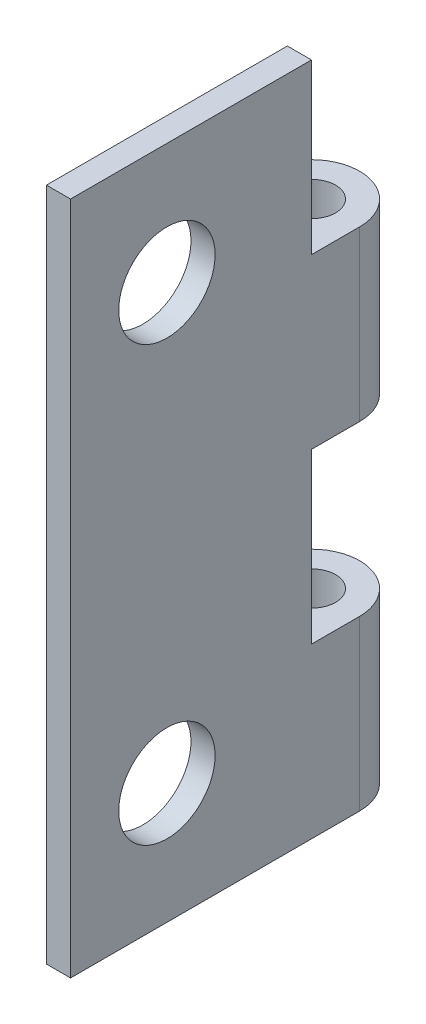
ISO-10303-21;
HEADER;
FILE_DESCRIPTION(('STEP AP214'),'2;1');
FILE_NAME('part.step','',(''),(''),'','','');
FILE_SCHEMA(('AUTOMOTIVE_DESIGN { 1 0 10303 214 1 1 1 1 }'));
ENDSEC;
DATA;
#1=APPLICATION_CONTEXT('core data for automotive mechanical design processes');
#2=APPLICATION_PROTOCOL_DEFINITION('international standard','automotive_design',2000,#1);
#3=PRODUCT_CONTEXT('',#1,'mechanical');
#4=PRODUCT('Part','Part','',(#3));
#5=PRODUCT_RELATED_PRODUCT_CATEGORY('part','',(#4));
#6=PRODUCT_DEFINITION_FORMATION('','',#4);
#7=PRODUCT_DEFINITION_CONTEXT('part definition',#1,'design');
#8=PRODUCT_DEFINITION('design','',#6,#7);
#9=PRODUCT_DEFINITION_SHAPE('','',#8);
#10=(LENGTH_UNIT() NAMED_UNIT(*) SI_UNIT(.MILLI.,.METRE.));
#11=(NAMED_UNIT(*) PLANE_ANGLE_UNIT() SI_UNIT($,.RADIAN.));
#12=(NAMED_UNIT(*) SI_UNIT($,.STERADIAN.) SOLID_ANGLE_UNIT());
#13=UNCERTAINTY_MEASURE_WITH_UNIT(LENGTH_MEASURE(1.E-05),#10,'distance_accuracy_value','');
#14=(GEOMETRIC_REPRESENTATION_CONTEXT(3) GLOBAL_UNCERTAINTY_ASSIGNED_CONTEXT((#13)) GLOBAL_UNIT_ASSIGNED_CONTEXT((#10,
#11,#12)) REPRESENTATION_CONTEXT('',''));
#15=CARTESIAN_POINT('',(0.,0.,0.));
#16=DIRECTION('',(0.,0.,1.));
#17=DIRECTION('',(1.,0.,0.));
#18=AXIS2_PLACEMENT_3D('',#15,#16,#17);
#19=CARTESIAN_POINT('',(-1.73331649571264,28.,-3.));
#20=DIRECTION('',(0.,-1.,0.));
#21=DIRECTION('',(0.,0.,-1.));
#22=AXIS2_PLACEMENT_3D('',#19,#20,#21);
#23=CYLINDRICAL_SURFACE('',#22,2.);
#24=DIRECTION('',(0.,-1.,0.));
#25=VECTOR('',#24,1.);
#26=CARTESIAN_POINT('',(-0.733316495712644,28.,-1.26794919243112));
#27=LINE('',#26,#25);
#28=CARTESIAN_POINT('',(-0.733316495712644,7.,-1.26794919243112));
#29=VERTEX_POINT('',#28);
#30=CARTESIAN_POINT('',(-0.733316495712644,0.,-1.26794919243112));
#31=VERTEX_POINT('',#30);
#32=EDGE_CURVE('E201',#29,#31,#27,.T.);
#33=ORIENTED_EDGE('',*,*,#32,.F.);
#34=CARTESIAN_POINT('',(-1.73331649571264,7.,-3.));
#35=DIRECTION('',(0.,-1.,0.));
#36=DIRECTION('',(0.,0.,-1.));
#37=AXIS2_PLACEMENT_3D('',#34,#35,#36);
#38=CIRCLE('',#37,2.);
#39=CARTESIAN_POINT('',(0.266683504287357,7.,-3.));
#40=VERTEX_POINT('',#39);
#41=EDGE_CURVE('E160',#29,#40,#38,.T.);
#42=ORIENTED_EDGE('',*,*,#41,.T.);
#43=DIRECTION('',(0.,-1.,0.));
#44=VECTOR('',#43,1.);
#45=CARTESIAN_POINT('',(0.266683504287357,28.,-3.));
#46=LINE('',#45,#44);
#47=CARTESIAN_POINT('',(0.266683504287357,0.,-3.));
#48=VERTEX_POINT('',#47);
#49=EDGE_CURVE('E182',#40,#48,#46,.T.);
#50=ORIENTED_EDGE('',*,*,#49,.T.);
#51=CARTESIAN_POINT('',(-1.73331649571264,0.,-3.));
#52=DIRECTION('',(0.,1.,0.));
#53=DIRECTION('',(0.,0.,1.));
#54=AXIS2_PLACEMENT_3D('',#51,#52,#53);
#55=CIRCLE('',#54,2.);
#56=EDGE_CURVE('E174',#48,#31,#55,.T.);
#57=ORIENTED_EDGE('',*,*,#56,.T.);
#58=EDGE_LOOP('',(#33,#42,#50,#57));
#59=FACE_BOUND('',#58,.T.);
#60=ADVANCED_FACE('F41',(#59),#23,.T.);
#61=CARTESIAN_POINT('',(-0.733316495712644,21.,-1.26794919243112));
#62=VERTEX_POINT('',#61);
#63=CARTESIAN_POINT('',(-0.733316495712644,14.,-1.26794919243112));
#64=VERTEX_POINT('',#63);
#65=EDGE_CURVE('E50',#62,#64,#27,.T.);
#66=ORIENTED_EDGE('',*,*,#65,.F.);
#67=CARTESIAN_POINT('',(-1.73331649571264,21.,-3.));
#68=DIRECTION('',(0.,-1.,0.));
#69=DIRECTION('',(0.,0.,-1.));
#70=AXIS2_PLACEMENT_3D('',#67,#68,#69);
#71=CIRCLE('',#70,2.);
#72=CARTESIAN_POINT('',(0.266683504287357,21.,-3.));
#73=VERTEX_POINT('',#72);
#74=EDGE_CURVE('E169',#62,#73,#71,.T.);
#75=ORIENTED_EDGE('',*,*,#74,.T.);
#76=CARTESIAN_POINT('',(0.266683504287357,14.,-3.));
#77=VERTEX_POINT('',#76);
#78=EDGE_CURVE('E139',#73,#77,#46,.T.);
#79=ORIENTED_EDGE('',*,*,#78,.T.);
#80=CARTESIAN_POINT('',(-1.73331649571264,14.,-3.));
#81=DIRECTION('',(0.,1.,0.));
#82=DIRECTION('',(0.,0.,1.));
#83=AXIS2_PLACEMENT_3D('',#80,#81,#82);
#84=CIRCLE('',#83,2.);
#85=EDGE_CURVE('E166',#77,#64,#84,.T.);
#86=ORIENTED_EDGE('',*,*,#85,.T.);
#87=EDGE_LOOP('',(#66,#75,#79,#86));
#88=FACE_BOUND('',#87,.T.);
#89=ADVANCED_FACE('F43',(#88),#23,.T.);
#90=CARTESIAN_POINT('',(-0.733316495712644,28.,0.));
#91=DIRECTION('',(1.,0.,0.));
#92=DIRECTION('',(0.,0.,-1.));
#93=AXIS2_PLACEMENT_3D('',#90,#91,#92);
#94=PLANE('',#93);
#95=CARTESIAN_POINT('',(-0.733316495712643,23.,5.));
#96=DIRECTION('',(1.,0.,0.));
#97=DIRECTION('',(0.,0.,-1.));
#98=AXIS2_PLACEMENT_3D('',#95,#96,#97);
#99=CIRCLE('',#98,2.);
#100=CARTESIAN_POINT('',(-0.733316495712643,23.,3.));
#101=VERTEX_POINT('',#100);
#102=EDGE_CURVE('E148',#101,#101,#99,.T.);
#103=ORIENTED_EDGE('',*,*,#102,.T.);
#104=EDGE_LOOP('',(#103));
#105=FACE_BOUND('',#104,.T.);
#106=CARTESIAN_POINT('',(-0.733316495712643,5.,5.));
#107=DIRECTION('',(1.,0.,0.));
#108=DIRECTION('',(0.,0.,-1.));
#109=AXIS2_PLACEMENT_3D('',#106,#107,#108);
#110=CIRCLE('',#109,2.);
#111=CARTESIAN_POINT('',(-0.733316495712643,5.,3.));
#112=VERTEX_POINT('',#111);
#113=EDGE_CURVE('E294',#112,#112,#110,.T.);
#114=ORIENTED_EDGE('',*,*,#113,.T.);
#115=EDGE_LOOP('',(#114));
#116=FACE_BOUND('',#115,.T.);
#117=DIRECTION('',(0.,0.,1.));
#118=VECTOR('',#117,1.);
#119=CARTESIAN_POINT('',(-0.733316495712644,28.,0.));
#120=LINE('',#119,#118);
#121=CARTESIAN_POINT('',(-0.733316495712644,28.,-1.));
#122=VERTEX_POINT('',#121);
#123=CARTESIAN_POINT('',(-0.733316495712643,28.,9.));
#124=VERTEX_POINT('',#123);
#125=EDGE_CURVE('E175',#122,#124,#120,.T.);
#126=ORIENTED_EDGE('',*,*,#125,.F.);
#127=DIRECTION('',(0.,-1.,0.));
#128=VECTOR('',#127,1.);
#129=CARTESIAN_POINT('',(-0.733316495712644,28.,-1.));
#130=LINE('',#129,#128);
#131=CARTESIAN_POINT('',(-0.733316495712644,21.,-1.));
#132=VERTEX_POINT('',#131);
#133=EDGE_CURVE('E65',#122,#132,#130,.T.);
#134=ORIENTED_EDGE('',*,*,#133,.T.);
#135=DIRECTION('',(0.,0.,-1.));
#136=VECTOR('',#135,1.);
#137=CARTESIAN_POINT('',(-0.733316495712644,21.,0.));
#138=LINE('',#137,#136);
#139=EDGE_CURVE('E127',#132,#62,#138,.T.);
#140=ORIENTED_EDGE('',*,*,#139,.T.);
#141=ORIENTED_EDGE('',*,*,#65,.T.);
#142=DIRECTION('',(0.,0.,1.));
#143=VECTOR('',#142,1.);
#144=CARTESIAN_POINT('',(-0.733316495712644,14.,0.));
#145=LINE('',#144,#143);
#146=CARTESIAN_POINT('',(-0.733316495712644,14.,-1.));
#147=VERTEX_POINT('',#146);
#148=EDGE_CURVE('E163',#64,#147,#145,.T.);
#149=ORIENTED_EDGE('',*,*,#148,.T.);
#150=DIRECTION('',(0.,-1.,0.));
#151=VECTOR('',#150,1.);
#152=CARTESIAN_POINT('',(-0.733316495712644,28.,-0.999999999999999));
#153=LINE('',#152,#151);
#154=CARTESIAN_POINT('',(-0.733316495712644,7.,-1.));
#155=VERTEX_POINT('',#154);
#156=EDGE_CURVE('E171',#147,#155,#153,.T.);
#157=ORIENTED_EDGE('',*,*,#156,.T.);
#158=DIRECTION('',(0.,0.,-1.));
#159=VECTOR('',#158,1.);
#160=CARTESIAN_POINT('',(-0.733316495712644,7.,0.));
#161=LINE('',#160,#159);
#162=EDGE_CURVE('E157',#155,#29,#161,.T.);
#163=ORIENTED_EDGE('',*,*,#162,.T.);
#164=ORIENTED_EDGE('',*,*,#32,.T.);
#165=DIRECTION('',(0.,0.,1.));
#166=VECTOR('',#165,1.);
#167=CARTESIAN_POINT('',(-0.733316495712644,0.,0.));
#168=LINE('',#167,#166);
#169=CARTESIAN_POINT('',(-0.733316495712643,0.,9.));
#170=VERTEX_POINT('',#169);
#171=EDGE_CURVE('E185',#31,#170,#168,.T.);
#172=ORIENTED_EDGE('',*,*,#171,.T.);
#173=DIRECTION('',(0.,-1.,0.));
#174=VECTOR('',#173,1.);
#175=CARTESIAN_POINT('',(-0.733316495712643,28.,9.));
#176=LINE('',#175,#174);
#177=EDGE_CURVE('E198',#124,#170,#176,.T.);
#178=ORIENTED_EDGE('',*,*,#177,.F.);
#179=EDGE_LOOP('',(#126,#134,#140,#141,#149,#157,#163,#164,#172,#178));
#180=FACE_BOUND('',#179,.T.);
#181=ADVANCED_FACE('F237',(#105,#116,#180),#94,.F.);
#182=CARTESIAN_POINT('',(0.,28.,9.));
#183=DIRECTION('',(0.,0.,-1.));
#184=DIRECTION('',(-1.,0.,0.));
#185=AXIS2_PLACEMENT_3D('',#182,#183,#184);
#186=PLANE('',#185);
#187=DIRECTION('',(1.,0.,0.));
#188=VECTOR('',#187,1.);
#189=CARTESIAN_POINT('',(0.,0.,9.));
#190=LINE('',#189,#188);
#191=CARTESIAN_POINT('',(0.266683504287357,0.,9.));
#192=VERTEX_POINT('',#191);
#193=EDGE_CURVE('E187',#170,#192,#190,.T.);
#194=ORIENTED_EDGE('',*,*,#193,.T.);
#195=DIRECTION('',(0.,-1.,0.));
#196=VECTOR('',#195,1.);
#197=CARTESIAN_POINT('',(0.266683504287357,28.,9.));
#198=LINE('',#197,#196);
#199=CARTESIAN_POINT('',(0.266683504287357,28.,9.));
#200=VERTEX_POINT('',#199);
#201=EDGE_CURVE('E195',#200,#192,#198,.T.);
#202=ORIENTED_EDGE('',*,*,#201,.F.);
#203=DIRECTION('',(1.,0.,0.));
#204=VECTOR('',#203,1.);
#205=CARTESIAN_POINT('',(0.,28.,9.));
#206=LINE('',#205,#204);
#207=EDGE_CURVE('E177',#124,#200,#206,.T.);
#208=ORIENTED_EDGE('',*,*,#207,.F.);
#209=ORIENTED_EDGE('',*,*,#177,.T.);
#210=EDGE_LOOP('',(#194,#202,#208,#209));
#211=FACE_BOUND('',#210,.T.);
#212=ADVANCED_FACE('F252',(#211),#186,.F.);
#213=CARTESIAN_POINT('',(0.266683504287357,28.,0.));
#214=DIRECTION('',(-1.,0.,0.));
#215=DIRECTION('',(0.,0.,1.));
#216=AXIS2_PLACEMENT_3D('',#213,#214,#215);
#217=PLANE('',#216);
#218=CARTESIAN_POINT('',(0.266683504287357,23.,5.));
#219=DIRECTION('',(1.,0.,0.));
#220=DIRECTION('',(0.,0.,-1.));
#221=AXIS2_PLACEMENT_3D('',#218,#219,#220);
#222=CIRCLE('',#221,2.);
#223=CARTESIAN_POINT('',(0.266683504287357,23.,3.));
#224=VERTEX_POINT('',#223);
#225=EDGE_CURVE('E290',#224,#224,#222,.T.);
#226=ORIENTED_EDGE('',*,*,#225,.F.);
#227=EDGE_LOOP('',(#226));
#228=FACE_BOUND('',#227,.T.);
#229=CARTESIAN_POINT('',(0.266683504287357,5.,5.));
#230=DIRECTION('',(1.,0.,0.));
#231=DIRECTION('',(0.,0.,-1.));
#232=AXIS2_PLACEMENT_3D('',#229,#230,#231);
#233=CIRCLE('',#232,2.);
#234=CARTESIAN_POINT('',(0.266683504287357,5.,3.));
#235=VERTEX_POINT('',#234);
#236=EDGE_CURVE('E298',#235,#235,#233,.T.);
#237=ORIENTED_EDGE('',*,*,#236,.F.);
#238=EDGE_LOOP('',(#237));
#239=FACE_BOUND('',#238,.T.);
#240=DIRECTION('',(0.,0.,-1.));
#241=VECTOR('',#240,1.);
#242=CARTESIAN_POINT('',(0.266683504287357,21.,-1.));
#243=LINE('',#242,#241);
#244=CARTESIAN_POINT('',(0.266683504287357,21.,-1.));
#245=VERTEX_POINT('',#244);
#246=EDGE_CURVE('E124',#245,#73,#243,.T.);
#247=ORIENTED_EDGE('',*,*,#246,.F.);
#248=DIRECTION('',(0.,-1.,0.));
#249=VECTOR('',#248,1.);
#250=CARTESIAN_POINT('',(0.266683504287357,28.,-1.));
#251=LINE('',#250,#249);
#252=CARTESIAN_POINT('',(0.266683504287357,28.,-1.));
#253=VERTEX_POINT('',#252);
#254=EDGE_CURVE('E130',#253,#245,#251,.T.);
#255=ORIENTED_EDGE('',*,*,#254,.F.);
#256=DIRECTION('',(0.,0.,-1.));
#257=VECTOR('',#256,1.);
#258=CARTESIAN_POINT('',(0.266683504287357,28.,0.));
#259=LINE('',#258,#257);
#260=EDGE_CURVE('E180',#200,#253,#259,.T.);
#261=ORIENTED_EDGE('',*,*,#260,.F.);
#262=ORIENTED_EDGE('',*,*,#201,.T.);
#263=DIRECTION('',(0.,0.,-1.));
#264=VECTOR('',#263,1.);
#265=CARTESIAN_POINT('',(0.266683504287357,0.,0.));
#266=LINE('',#265,#264);
#267=EDGE_CURVE('E189',#192,#48,#266,.T.);
#268=ORIENTED_EDGE('',*,*,#267,.T.);
#269=ORIENTED_EDGE('',*,*,#49,.F.);
#270=DIRECTION('',(0.,0.,-1.));
#271=VECTOR('',#270,1.);
#272=CARTESIAN_POINT('',(0.266683504287357,7.,-1.));
#273=LINE('',#272,#271);
#274=CARTESIAN_POINT('',(0.266683504287357,7.,-1.));
#275=VERTEX_POINT('',#274);
#276=EDGE_CURVE('E151',#275,#40,#273,.T.);
#277=ORIENTED_EDGE('',*,*,#276,.F.);
#278=DIRECTION('',(0.,-1.,0.));
#279=VECTOR('',#278,1.);
#280=CARTESIAN_POINT('',(0.266683504287357,14.,-1.));
#281=LINE('',#280,#279);
#282=CARTESIAN_POINT('',(0.266683504287357,14.,-1.));
#283=VERTEX_POINT('',#282);
#284=EDGE_CURVE('E58',#283,#275,#281,.T.);
#285=ORIENTED_EDGE('',*,*,#284,.F.);
#286=DIRECTION('',(0.,0.,1.));
#287=VECTOR('',#286,1.);
#288=CARTESIAN_POINT('',(0.266683504287357,14.,-1.));
#289=LINE('',#288,#287);
#290=EDGE_CURVE('E145',#77,#283,#289,.T.);
#291=ORIENTED_EDGE('',*,*,#290,.F.);
#292=ORIENTED_EDGE('',*,*,#78,.F.);
#293=EDGE_LOOP('',(#247,#255,#261,#262,#268,#269,#277,#285,#291,#292));
#294=FACE_BOUND('',#293,.T.);
#295=ADVANCED_FACE('F136',(#228,#239,#294),#217,.F.);
#296=CARTESIAN_POINT('',(-1.73331649571264,28.,-3.));
#297=DIRECTION('',(0.,-1.,0.));
#298=DIRECTION('',(0.,0.,-1.));
#299=AXIS2_PLACEMENT_3D('',#296,#297,#298);
#300=CYLINDRICAL_SURFACE('',#299,0.999999999999998);
#301=CARTESIAN_POINT('',(-1.73331649571264,7.,-3.));
#302=DIRECTION('',(0.,-1.,0.));
#303=DIRECTION('',(0.,0.,-1.));
#304=AXIS2_PLACEMENT_3D('',#301,#302,#303);
#305=CIRCLE('',#304,0.999999999999998);
#306=CARTESIAN_POINT('',(-1.73331649571264,7.,-4.));
#307=VERTEX_POINT('',#306);
#308=EDGE_CURVE('E156',#307,#307,#305,.T.);
#309=ORIENTED_EDGE('',*,*,#308,.F.);
#310=EDGE_LOOP('',(#309));
#311=FACE_BOUND('',#310,.T.);
#312=CARTESIAN_POINT('',(-1.73331649571264,0.,-3.));
#313=DIRECTION('',(0.,1.,0.));
#314=DIRECTION('',(0.,0.,1.));
#315=AXIS2_PLACEMENT_3D('',#312,#313,#314);
#316=CIRCLE('',#315,0.999999999999998);
#317=CARTESIAN_POINT('',(-1.73331649571264,0.,-2.));
#318=VERTEX_POINT('',#317);
#319=EDGE_CURVE('E178',#318,#318,#316,.T.);
#320=ORIENTED_EDGE('',*,*,#319,.F.);
#321=EDGE_LOOP('',(#320));
#322=FACE_BOUND('',#321,.T.);
#323=ADVANCED_FACE('F216',(#311,#322),#300,.F.);
#324=CARTESIAN_POINT('',(0.,28.,0.));
#325=DIRECTION('',(0.,1.,0.));
#326=DIRECTION('',(0.,0.,1.));
#327=AXIS2_PLACEMENT_3D('',#324,#325,#326);
#328=PLANE('',#327);
#329=DIRECTION('',(1.,0.,0.));
#330=VECTOR('',#329,1.);
#331=CARTESIAN_POINT('',(0.,28.,-1.));
#332=LINE('',#331,#330);
#333=EDGE_CURVE('E11',#122,#253,#332,.T.);
#334=ORIENTED_EDGE('',*,*,#333,.F.);
#335=ORIENTED_EDGE('',*,*,#125,.T.);
#336=ORIENTED_EDGE('',*,*,#207,.T.);
#337=ORIENTED_EDGE('',*,*,#260,.T.);
#338=EDGE_LOOP('',(#334,#335,#336,#337));
#339=FACE_BOUND('',#338,.T.);
#340=ADVANCED_FACE('F230',(#339),#328,.T.);
#341=CARTESIAN_POINT('',(0.,0.,0.));
#342=DIRECTION('',(0.,1.,0.));
#343=DIRECTION('',(0.,0.,1.));
#344=AXIS2_PLACEMENT_3D('',#341,#342,#343);
#345=PLANE('',#344);
#346=ORIENTED_EDGE('',*,*,#56,.F.);
#347=ORIENTED_EDGE('',*,*,#267,.F.);
#348=ORIENTED_EDGE('',*,*,#193,.F.);
#349=ORIENTED_EDGE('',*,*,#171,.F.);
#350=EDGE_LOOP('',(#346,#347,#348,#349));
#351=FACE_BOUND('',#350,.T.);
#352=ORIENTED_EDGE('',*,*,#319,.T.);
#353=EDGE_LOOP('',(#352));
#354=FACE_BOUND('',#353,.T.);
#355=ADVANCED_FACE('F247',(#351,#354),#345,.F.);
#356=CARTESIAN_POINT('',(-3.73331649571264,21.,-1.));
#357=DIRECTION('',(0.,-1.,0.));
#358=DIRECTION('',(0.,0.,-1.));
#359=AXIS2_PLACEMENT_3D('',#356,#357,#358);
#360=PLANE('',#359);
#361=CARTESIAN_POINT('',(-1.73331649571264,21.,-3.));
#362=DIRECTION('',(0.,-1.,0.));
#363=DIRECTION('',(0.,0.,-1.));
#364=AXIS2_PLACEMENT_3D('',#361,#362,#363);
#365=CIRCLE('',#364,0.999999999999998);
#366=CARTESIAN_POINT('',(-1.73331649571264,21.,-4.));
#367=VERTEX_POINT('',#366);
#368=EDGE_CURVE('E45',#367,#367,#365,.T.);
#369=ORIENTED_EDGE('',*,*,#368,.T.);
#370=EDGE_LOOP('',(#369));
#371=FACE_BOUND('',#370,.T.);
#372=ORIENTED_EDGE('',*,*,#74,.F.);
#373=ORIENTED_EDGE('',*,*,#139,.F.);
#374=DIRECTION('',(1.,0.,0.));
#375=VECTOR('',#374,1.);
#376=CARTESIAN_POINT('',(-3.73331649571264,21.,-1.));
#377=LINE('',#376,#375);
#378=EDGE_CURVE('E120',#132,#245,#377,.T.);
#379=ORIENTED_EDGE('',*,*,#378,.T.);
#380=ORIENTED_EDGE('',*,*,#246,.T.);
#381=EDGE_LOOP('',(#372,#373,#379,#380));
#382=FACE_BOUND('',#381,.T.);
#383=ADVANCED_FACE('F122',(#371,#382),#360,.F.);
#384=CARTESIAN_POINT('',(-3.73331649571264,28.,-1.));
#385=DIRECTION('',(0.,0.,1.));
#386=DIRECTION('',(0.,-1.,0.));
#387=AXIS2_PLACEMENT_3D('',#384,#385,#386);
#388=PLANE('',#387);
#389=ORIENTED_EDGE('',*,*,#333,.T.);
#390=ORIENTED_EDGE('',*,*,#254,.T.);
#391=ORIENTED_EDGE('',*,*,#378,.F.);
#392=ORIENTED_EDGE('',*,*,#133,.F.);
#393=EDGE_LOOP('',(#389,#390,#391,#392));
#394=FACE_BOUND('',#393,.T.);
#395=ADVANCED_FACE('F131',(#394),#388,.F.);
#396=CARTESIAN_POINT('',(-3.73331649571264,14.,-1.));
#397=DIRECTION('',(0.,0.,1.));
#398=DIRECTION('',(0.,-1.,0.));
#399=AXIS2_PLACEMENT_3D('',#396,#397,#398);
#400=PLANE('',#399);
#401=DIRECTION('',(1.,0.,0.));
#402=VECTOR('',#401,1.);
#403=CARTESIAN_POINT('',(-3.73331649571264,14.,-1.));
#404=LINE('',#403,#402);
#405=EDGE_CURVE('E146',#147,#283,#404,.T.);
#406=ORIENTED_EDGE('',*,*,#405,.T.);
#407=ORIENTED_EDGE('',*,*,#284,.T.);
#408=DIRECTION('',(1.,0.,0.));
#409=VECTOR('',#408,1.);
#410=CARTESIAN_POINT('',(-3.73331649571264,7.,-1.));
#411=LINE('',#410,#409);
#412=EDGE_CURVE('E143',#155,#275,#411,.T.);
#413=ORIENTED_EDGE('',*,*,#412,.F.);
#414=ORIENTED_EDGE('',*,*,#156,.F.);
#415=EDGE_LOOP('',(#406,#407,#413,#414));
#416=FACE_BOUND('',#415,.T.);
#417=ADVANCED_FACE('F260',(#416),#400,.F.);
#418=CARTESIAN_POINT('',(-3.73331649571264,14.,-1.));
#419=DIRECTION('',(0.,1.,0.));
#420=DIRECTION('',(0.,0.,1.));
#421=AXIS2_PLACEMENT_3D('',#418,#419,#420);
#422=PLANE('',#421);
#423=CARTESIAN_POINT('',(-1.73331649571264,14.,-3.));
#424=DIRECTION('',(0.,1.,0.));
#425=DIRECTION('',(0.,0.,1.));
#426=AXIS2_PLACEMENT_3D('',#423,#424,#425);
#427=CIRCLE('',#426,0.999999999999998);
#428=CARTESIAN_POINT('',(-1.73331649571264,14.,-2.));
#429=VERTEX_POINT('',#428);
#430=EDGE_CURVE('E162',#429,#429,#427,.T.);
#431=ORIENTED_EDGE('',*,*,#430,.T.);
#432=EDGE_LOOP('',(#431));
#433=FACE_BOUND('',#432,.T.);
#434=ORIENTED_EDGE('',*,*,#290,.T.);
#435=ORIENTED_EDGE('',*,*,#405,.F.);
#436=ORIENTED_EDGE('',*,*,#148,.F.);
#437=ORIENTED_EDGE('',*,*,#85,.F.);
#438=EDGE_LOOP('',(#434,#435,#436,#437));
#439=FACE_BOUND('',#438,.T.);
#440=ADVANCED_FACE('F207',(#433,#439),#422,.F.);
#441=CARTESIAN_POINT('',(-3.73331649571264,7.,-1.));
#442=DIRECTION('',(0.,-1.,0.));
#443=DIRECTION('',(0.,0.,-1.));
#444=AXIS2_PLACEMENT_3D('',#441,#442,#443);
#445=PLANE('',#444);
#446=ORIENTED_EDGE('',*,*,#308,.T.);
#447=EDGE_LOOP('',(#446));
#448=FACE_BOUND('',#447,.T.);
#449=ORIENTED_EDGE('',*,*,#41,.F.);
#450=ORIENTED_EDGE('',*,*,#162,.F.);
#451=ORIENTED_EDGE('',*,*,#412,.T.);
#452=ORIENTED_EDGE('',*,*,#276,.T.);
#453=EDGE_LOOP('',(#449,#450,#451,#452));
#454=FACE_BOUND('',#453,.T.);
#455=ADVANCED_FACE('F213',(#448,#454),#445,.F.);
#456=ORIENTED_EDGE('',*,*,#368,.F.);
#457=EDGE_LOOP('',(#456));
#458=FACE_BOUND('',#457,.T.);
#459=ORIENTED_EDGE('',*,*,#430,.F.);
#460=EDGE_LOOP('',(#459));
#461=FACE_BOUND('',#460,.T.);
#462=ADVANCED_FACE('F210',(#458,#461),#300,.F.);
#463=CARTESIAN_POINT('',(-3.73331649571264,5.,5.));
#464=DIRECTION('',(1.,0.,0.));
#465=DIRECTION('',(0.,0.,-1.));
#466=AXIS2_PLACEMENT_3D('',#463,#464,#465);
#467=CYLINDRICAL_SURFACE('',#466,2.);
#468=ORIENTED_EDGE('',*,*,#236,.T.);
#469=EDGE_LOOP('',(#468));
#470=FACE_BOUND('',#469,.T.);
#471=ORIENTED_EDGE('',*,*,#113,.F.);
#472=EDGE_LOOP('',(#471));
#473=FACE_BOUND('',#472,.T.);
#474=ADVANCED_FACE('F212',(#470,#473),#467,.F.);
#475=CARTESIAN_POINT('',(-3.73331649571264,23.,5.));
#476=DIRECTION('',(1.,0.,0.));
#477=DIRECTION('',(0.,0.,-1.));
#478=AXIS2_PLACEMENT_3D('',#475,#476,#477);
#479=CYLINDRICAL_SURFACE('',#478,2.);
#480=ORIENTED_EDGE('',*,*,#225,.T.);
#481=EDGE_LOOP('',(#480));
#482=FACE_BOUND('',#481,.T.);
#483=ORIENTED_EDGE('',*,*,#102,.F.);
#484=EDGE_LOOP('',(#483));
#485=FACE_BOUND('',#484,.T.);
#486=ADVANCED_FACE('F221',(#482,#485),#479,.F.);
#487=CLOSED_SHELL('',(#60,#89,#181,#212,#295,#323,#340,#355,#383,#395,#417,#440,#455,#462,#474,#486));
#488=MANIFOLD_SOLID_BREP('B2',#487);
#489=ADVANCED_BREP_SHAPE_REPRESENTATION('',(#18,#488),#14);
#490=SHAPE_DEFINITION_REPRESENTATION(#9,#489);
ENDSEC;
END-ISO-10303-21;
